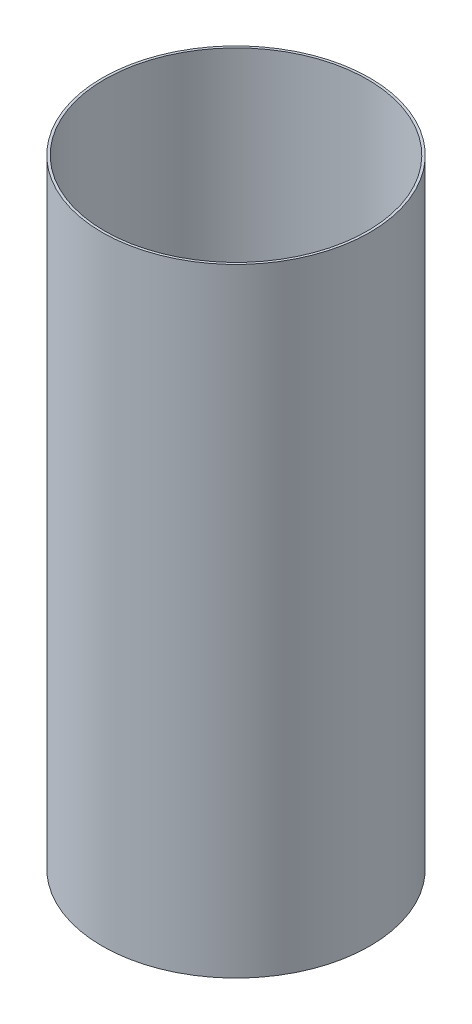
ISO-10303-21;
HEADER;
FILE_DESCRIPTION(('STEP AP214'),'2;1');
FILE_NAME('part.step','',(''),(''),'','','');
FILE_SCHEMA(('AUTOMOTIVE_DESIGN { 1 0 10303 214 1 1 1 1 }'));
ENDSEC;
DATA;
#1=APPLICATION_CONTEXT('core data for automotive mechanical design processes');
#2=APPLICATION_PROTOCOL_DEFINITION('international standard','automotive_design',2000,#1);
#3=PRODUCT_CONTEXT('',#1,'mechanical');
#4=PRODUCT('Part','Part','',(#3));
#5=PRODUCT_RELATED_PRODUCT_CATEGORY('part','',(#4));
#6=PRODUCT_DEFINITION_FORMATION('','',#4);
#7=PRODUCT_DEFINITION_CONTEXT('part definition',#1,'design');
#8=PRODUCT_DEFINITION('design','',#6,#7);
#9=PRODUCT_DEFINITION_SHAPE('','',#8);
#10=(LENGTH_UNIT() NAMED_UNIT(*) SI_UNIT(.MILLI.,.METRE.));
#11=(NAMED_UNIT(*) PLANE_ANGLE_UNIT() SI_UNIT($,.RADIAN.));
#12=(NAMED_UNIT(*) SI_UNIT($,.STERADIAN.) SOLID_ANGLE_UNIT());
#13=UNCERTAINTY_MEASURE_WITH_UNIT(LENGTH_MEASURE(1.E-05),#10,'distance_accuracy_value','');
#14=(GEOMETRIC_REPRESENTATION_CONTEXT(3) GLOBAL_UNCERTAINTY_ASSIGNED_CONTEXT((#13)) GLOBAL_UNIT_ASSIGNED_CONTEXT((#10,
#11,#12)) REPRESENTATION_CONTEXT('',''));
#15=CARTESIAN_POINT('',(0.,0.,0.));
#16=DIRECTION('',(0.,0.,1.));
#17=DIRECTION('',(1.,0.,0.));
#18=AXIS2_PLACEMENT_3D('',#15,#16,#17);
#19=CARTESIAN_POINT('',(0.,254.,0.));
#20=DIRECTION('',(0.,1.,0.));
#21=DIRECTION('',(0.,0.,1.));
#22=AXIS2_PLACEMENT_3D('',#19,#20,#21);
#23=PLANE('',#22);
#24=CARTESIAN_POINT('',(0.,254.,0.));
#25=DIRECTION('',(0.,1.,0.));
#26=DIRECTION('',(0.,0.,1.));
#27=AXIS2_PLACEMENT_3D('',#24,#25,#26);
#28=CIRCLE('',#27,55.);
#29=CARTESIAN_POINT('',(0.,254.,55.));
#30=VERTEX_POINT('',#29);
#31=EDGE_CURVE('E10',#30,#30,#28,.T.);
#32=ORIENTED_EDGE('',*,*,#31,.T.);
#33=EDGE_LOOP('',(#32));
#34=FACE_BOUND('',#33,.T.);
#35=CARTESIAN_POINT('',(0.,254.,0.));
#36=DIRECTION('',(0.,1.,0.));
#37=DIRECTION('',(0.,0.,1.));
#38=AXIS2_PLACEMENT_3D('',#35,#36,#37);
#39=CIRCLE('',#38,54.);
#40=CARTESIAN_POINT('',(0.,254.,54.));
#41=VERTEX_POINT('',#40);
#42=EDGE_CURVE('E54',#41,#41,#39,.T.);
#43=ORIENTED_EDGE('',*,*,#42,.F.);
#44=EDGE_LOOP('',(#43));
#45=FACE_BOUND('',#44,.T.);
#46=ADVANCED_FACE('F43',(#34,#45),#23,.T.);
#47=CARTESIAN_POINT('',(0.,0.,0.));
#48=DIRECTION('',(0.,1.,0.));
#49=DIRECTION('',(0.,0.,1.));
#50=AXIS2_PLACEMENT_3D('',#47,#48,#49);
#51=PLANE('',#50);
#52=CARTESIAN_POINT('',(0.,0.,0.));
#53=DIRECTION('',(0.,1.,0.));
#54=DIRECTION('',(0.,0.,1.));
#55=AXIS2_PLACEMENT_3D('',#52,#53,#54);
#56=CIRCLE('',#55,55.);
#57=CARTESIAN_POINT('',(0.,0.,55.));
#58=VERTEX_POINT('',#57);
#59=EDGE_CURVE('E47',#58,#58,#56,.T.);
#60=ORIENTED_EDGE('',*,*,#59,.F.);
#61=EDGE_LOOP('',(#60));
#62=FACE_BOUND('',#61,.T.);
#63=CARTESIAN_POINT('',(0.,0.,0.));
#64=DIRECTION('',(0.,1.,0.));
#65=DIRECTION('',(0.,0.,1.));
#66=AXIS2_PLACEMENT_3D('',#63,#64,#65);
#67=CIRCLE('',#66,54.);
#68=CARTESIAN_POINT('',(0.,0.,54.));
#69=VERTEX_POINT('',#68);
#70=EDGE_CURVE('E56',#69,#69,#67,.T.);
#71=ORIENTED_EDGE('',*,*,#70,.T.);
#72=EDGE_LOOP('',(#71));
#73=FACE_BOUND('',#72,.T.);
#74=ADVANCED_FACE('F66',(#62,#73),#51,.F.);
#75=CARTESIAN_POINT('',(0.,254.,0.));
#76=DIRECTION('',(0.,-1.,0.));
#77=DIRECTION('',(0.,0.,-1.));
#78=AXIS2_PLACEMENT_3D('',#75,#76,#77);
#79=CYLINDRICAL_SURFACE('',#78,55.);
#80=ORIENTED_EDGE('',*,*,#31,.F.);
#81=EDGE_LOOP('',(#80));
#82=FACE_BOUND('',#81,.T.);
#83=ORIENTED_EDGE('',*,*,#59,.T.);
#84=EDGE_LOOP('',(#83));
#85=FACE_BOUND('',#84,.T.);
#86=ADVANCED_FACE('F45',(#82,#85),#79,.T.);
#87=CARTESIAN_POINT('',(0.,254.,0.));
#88=DIRECTION('',(0.,-1.,0.));
#89=DIRECTION('',(0.,0.,-1.));
#90=AXIS2_PLACEMENT_3D('',#87,#88,#89);
#91=CYLINDRICAL_SURFACE('',#90,54.);
#92=ORIENTED_EDGE('',*,*,#42,.T.);
#93=EDGE_LOOP('',(#92));
#94=FACE_BOUND('',#93,.T.);
#95=ORIENTED_EDGE('',*,*,#70,.F.);
#96=EDGE_LOOP('',(#95));
#97=FACE_BOUND('',#96,.T.);
#98=ADVANCED_FACE('F62',(#94,#97),#91,.F.);
#99=CLOSED_SHELL('',(#46,#74,#86,#98));
#100=MANIFOLD_SOLID_BREP('B2',#99);
#101=ADVANCED_BREP_SHAPE_REPRESENTATION('',(#18,#100),#14);
#102=SHAPE_DEFINITION_REPRESENTATION(#9,#101);
ENDSEC;
END-ISO-10303-21;
